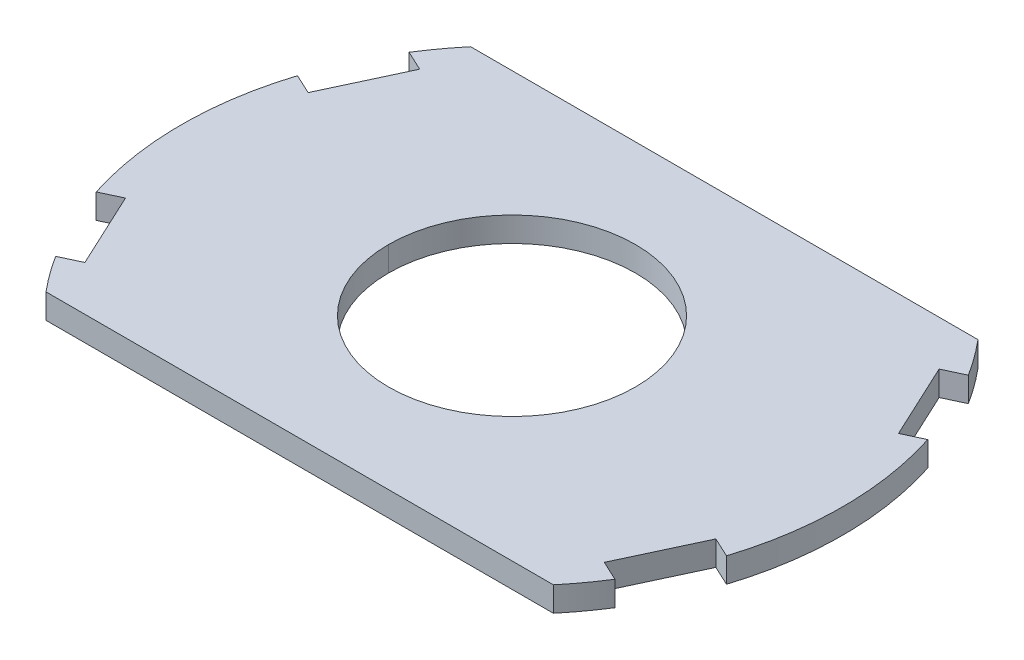
ISO-10303-21;
HEADER;
FILE_DESCRIPTION(('STEP AP214'),'2;1');
FILE_NAME('part.step','',(''),(''),'','','');
FILE_SCHEMA(('AUTOMOTIVE_DESIGN { 1 0 10303 214 1 1 1 1 }'));
ENDSEC;
DATA;
#1=APPLICATION_CONTEXT('core data for automotive mechanical design processes');
#2=APPLICATION_PROTOCOL_DEFINITION('international standard','automotive_design',2000,#1);
#3=PRODUCT_CONTEXT('',#1,'mechanical');
#4=PRODUCT('Part','Part','',(#3));
#5=PRODUCT_RELATED_PRODUCT_CATEGORY('part','',(#4));
#6=PRODUCT_DEFINITION_FORMATION('','',#4);
#7=PRODUCT_DEFINITION_CONTEXT('part definition',#1,'design');
#8=PRODUCT_DEFINITION('design','',#6,#7);
#9=PRODUCT_DEFINITION_SHAPE('','',#8);
#10=(LENGTH_UNIT() NAMED_UNIT(*) SI_UNIT(.MILLI.,.METRE.));
#11=(NAMED_UNIT(*) PLANE_ANGLE_UNIT() SI_UNIT($,.RADIAN.));
#12=(NAMED_UNIT(*) SI_UNIT($,.STERADIAN.) SOLID_ANGLE_UNIT());
#13=UNCERTAINTY_MEASURE_WITH_UNIT(LENGTH_MEASURE(1.E-05),#10,'distance_accuracy_value','');
#14=(GEOMETRIC_REPRESENTATION_CONTEXT(3) GLOBAL_UNCERTAINTY_ASSIGNED_CONTEXT((#13)) GLOBAL_UNIT_ASSIGNED_CONTEXT((#10,
#11,#12)) REPRESENTATION_CONTEXT('',''));
#15=CARTESIAN_POINT('',(0.,0.,0.));
#16=DIRECTION('',(0.,0.,1.));
#17=DIRECTION('',(1.,0.,0.));
#18=AXIS2_PLACEMENT_3D('',#15,#16,#17);
#19=CARTESIAN_POINT('',(0.,0.,0.));
#20=DIRECTION('',(0.,-1.,0.));
#21=DIRECTION('',(1.,0.,0.));
#22=AXIS2_PLACEMENT_3D('',#19,#20,#21);
#23=CYLINDRICAL_SURFACE('',#22,3.175);
#24=DIRECTION('',(0.,1.,0.));
#25=VECTOR('',#24,1.);
#26=CARTESIAN_POINT('',(3.175,0.,0.));
#27=LINE('',#26,#25);
#28=CARTESIAN_POINT('',(3.175,0.,0.));
#29=VERTEX_POINT('',#28);
#30=CARTESIAN_POINT('',(3.175,0.635,0.));
#31=VERTEX_POINT('',#30);
#32=EDGE_CURVE('E11',#29,#31,#27,.T.);
#33=ORIENTED_EDGE('',*,*,#32,.T.);
#34=CARTESIAN_POINT('',(0.,0.635,0.));
#35=DIRECTION('',(0.,-1.,0.));
#36=DIRECTION('',(-1.,0.,0.));
#37=AXIS2_PLACEMENT_3D('',#34,#35,#36);
#38=CIRCLE('',#37,3.175);
#39=CARTESIAN_POINT('',(-3.175,0.635,0.));
#40=VERTEX_POINT('',#39);
#41=EDGE_CURVE('E400',#40,#31,#38,.T.);
#42=ORIENTED_EDGE('',*,*,#41,.F.);
#43=DIRECTION('',(0.,1.,0.));
#44=VECTOR('',#43,1.);
#45=CARTESIAN_POINT('',(-3.175,0.,0.));
#46=LINE('',#45,#44);
#47=CARTESIAN_POINT('',(-3.175,0.,0.));
#48=VERTEX_POINT('',#47);
#49=EDGE_CURVE('E20',#48,#40,#46,.T.);
#50=ORIENTED_EDGE('',*,*,#49,.F.);
#51=CARTESIAN_POINT('',(0.,0.,0.));
#52=DIRECTION('',(0.,-1.,0.));
#53=DIRECTION('',(-1.,0.,0.));
#54=AXIS2_PLACEMENT_3D('',#51,#52,#53);
#55=CIRCLE('',#54,3.175);
#56=EDGE_CURVE('E306',#48,#29,#55,.T.);
#57=ORIENTED_EDGE('',*,*,#56,.T.);
#58=EDGE_LOOP('',(#33,#42,#50,#57));
#59=FACE_BOUND('',#58,.T.);
#60=ADVANCED_FACE('F17',(#59),#23,.F.);
#61=CARTESIAN_POINT('',(0.,0.,0.));
#62=DIRECTION('',(0.,-1.,0.));
#63=DIRECTION('',(1.,0.,0.));
#64=AXIS2_PLACEMENT_3D('',#61,#62,#63);
#65=CYLINDRICAL_SURFACE('',#64,3.175);
#66=ORIENTED_EDGE('',*,*,#49,.T.);
#67=CARTESIAN_POINT('',(0.,0.635,0.));
#68=DIRECTION('',(0.,-1.,0.));
#69=DIRECTION('',(1.,0.,0.));
#70=AXIS2_PLACEMENT_3D('',#67,#68,#69);
#71=CIRCLE('',#70,3.175);
#72=EDGE_CURVE('E404',#31,#40,#71,.T.);
#73=ORIENTED_EDGE('',*,*,#72,.F.);
#74=ORIENTED_EDGE('',*,*,#32,.F.);
#75=CARTESIAN_POINT('',(0.,0.,0.));
#76=DIRECTION('',(0.,-1.,0.));
#77=DIRECTION('',(1.,0.,0.));
#78=AXIS2_PLACEMENT_3D('',#75,#76,#77);
#79=CIRCLE('',#78,3.175);
#80=EDGE_CURVE('E309',#29,#48,#79,.T.);
#81=ORIENTED_EDGE('',*,*,#80,.T.);
#82=EDGE_LOOP('',(#66,#73,#74,#81));
#83=FACE_BOUND('',#82,.T.);
#84=ADVANCED_FACE('F608',(#83),#65,.F.);
#85=CARTESIAN_POINT('',(6.52537814996182,0.,-5.461));
#86=DIRECTION('',(0.,0.,-1.));
#87=DIRECTION('',(0.,-1.,0.));
#88=AXIS2_PLACEMENT_3D('',#85,#86,#87);
#89=PLANE('',#88);
#90=DIRECTION('',(0.,1.,0.));
#91=VECTOR('',#90,1.);
#92=CARTESIAN_POINT('',(-6.52537814996182,0.,-5.461));
#93=LINE('',#92,#91);
#94=CARTESIAN_POINT('',(-6.52537814996182,0.,-5.461));
#95=VERTEX_POINT('',#94);
#96=CARTESIAN_POINT('',(-6.52537814996182,0.635,-5.461));
#97=VERTEX_POINT('',#96);
#98=EDGE_CURVE('E321',#95,#97,#93,.T.);
#99=ORIENTED_EDGE('',*,*,#98,.T.);
#100=DIRECTION('',(-1.,0.,0.));
#101=VECTOR('',#100,1.);
#102=CARTESIAN_POINT('',(6.52537814996182,0.635,-5.461));
#103=LINE('',#102,#101);
#104=CARTESIAN_POINT('',(6.52537814996182,0.635,-5.461));
#105=VERTEX_POINT('',#104);
#106=EDGE_CURVE('E361',#105,#97,#103,.T.);
#107=ORIENTED_EDGE('',*,*,#106,.F.);
#108=DIRECTION('',(0.,1.,0.));
#109=VECTOR('',#108,1.);
#110=CARTESIAN_POINT('',(6.52537814996182,0.,-5.461));
#111=LINE('',#110,#109);
#112=CARTESIAN_POINT('',(6.52537814996182,0.,-5.461));
#113=VERTEX_POINT('',#112);
#114=EDGE_CURVE('E342',#113,#105,#111,.T.);
#115=ORIENTED_EDGE('',*,*,#114,.F.);
#116=DIRECTION('',(-1.,0.,0.));
#117=VECTOR('',#116,1.);
#118=CARTESIAN_POINT('',(6.52537814996182,0.,-5.461));
#119=LINE('',#118,#117);
#120=EDGE_CURVE('E284',#113,#95,#119,.T.);
#121=ORIENTED_EDGE('',*,*,#120,.T.);
#122=EDGE_LOOP('',(#99,#107,#115,#121));
#123=FACE_BOUND('',#122,.T.);
#124=ADVANCED_FACE('F600',(#123),#89,.T.);
#125=CARTESIAN_POINT('',(-7.19324470152094,0.,4.54536155482132));
#126=DIRECTION('',(0.422618261740681,0.,0.906307787036659));
#127=DIRECTION('',(0.,-1.,0.));
#128=AXIS2_PLACEMENT_3D('',#125,#126,#127);
#129=PLANE('',#128);
#130=DIRECTION('',(0.,1.,0.));
#131=VECTOR('',#130,1.);
#132=CARTESIAN_POINT('',(-7.19324470152094,0.,4.54536155482132));
#133=LINE('',#132,#131);
#134=CARTESIAN_POINT('',(-7.19324470152094,0.,4.54536155482132));
#135=VERTEX_POINT('',#134);
#136=CARTESIAN_POINT('',(-7.19324470152094,0.635,4.54536155482132));
#137=VERTEX_POINT('',#136);
#138=EDGE_CURVE('E233',#135,#137,#133,.T.);
#139=ORIENTED_EDGE('',*,*,#138,.T.);
#140=DIRECTION('',(0.906307787036641,0.,-0.422618261740719));
#141=VECTOR('',#140,1.);
#142=CARTESIAN_POINT('',(-7.19324470152094,0.635,4.54536155482132));
#143=LINE('',#142,#141);
#144=CARTESIAN_POINT('',(-6.68005110157796,0.635,4.30605544905298));
#145=VERTEX_POINT('',#144);
#146=EDGE_CURVE('E384',#137,#145,#143,.T.);
#147=ORIENTED_EDGE('',*,*,#146,.T.);
#148=DIRECTION('',(0.,1.,0.));
#149=VECTOR('',#148,1.);
#150=CARTESIAN_POINT('',(-6.68005110157796,0.,4.30605544905298));
#151=LINE('',#150,#149);
#152=CARTESIAN_POINT('',(-6.68005110157796,0.,4.30605544905298));
#153=VERTEX_POINT('',#152);
#154=EDGE_CURVE('E429',#153,#145,#151,.T.);
#155=ORIENTED_EDGE('',*,*,#154,.F.);
#156=DIRECTION('',(0.906307787036641,0.,-0.422618261740719));
#157=VECTOR('',#156,1.);
#158=CARTESIAN_POINT('',(-7.19324470152094,0.,4.54536155482132));
#159=LINE('',#158,#157);
#160=EDGE_CURVE('E238',#135,#153,#159,.T.);
#161=ORIENTED_EDGE('',*,*,#160,.F.);
#162=EDGE_LOOP('',(#139,#147,#155,#161));
#163=FACE_BOUND('',#162,.T.);
#164=ADVANCED_FACE('F593',(#163),#129,.F.);
#165=CARTESIAN_POINT('',(-6.68005110157796,0.,4.30605544905298));
#166=DIRECTION('',(0.906307787036641,0.,-0.422618261740719));
#167=DIRECTION('',(0.,-1.,0.));
#168=AXIS2_PLACEMENT_3D('',#165,#166,#167);
#169=PLANE('',#168);
#170=ORIENTED_EDGE('',*,*,#154,.T.);
#171=DIRECTION('',(-0.422618261740681,0.,-0.906307787036659));
#172=VECTOR('',#171,1.);
#173=CARTESIAN_POINT('',(-6.68005110157796,0.635,4.30605544905298));
#174=LINE('',#173,#172);
#175=CARTESIAN_POINT('',(-7.59248392867462,0.635,2.34933693684022));
#176=VERTEX_POINT('',#175);
#177=EDGE_CURVE('E376',#145,#176,#174,.T.);
#178=ORIENTED_EDGE('',*,*,#177,.T.);
#179=DIRECTION('',(0.,1.,0.));
#180=VECTOR('',#179,1.);
#181=CARTESIAN_POINT('',(-7.59248392867462,0.,2.34933693684022));
#182=LINE('',#181,#180);
#183=CARTESIAN_POINT('',(-7.59248392867462,0.,2.34933693684022));
#184=VERTEX_POINT('',#183);
#185=EDGE_CURVE('E427',#184,#176,#182,.T.);
#186=ORIENTED_EDGE('',*,*,#185,.F.);
#187=DIRECTION('',(-0.422618261740681,0.,-0.906307787036659));
#188=VECTOR('',#187,1.);
#189=CARTESIAN_POINT('',(-6.68005110157796,0.,4.30605544905298));
#190=LINE('',#189,#188);
#191=EDGE_CURVE('E254',#153,#184,#190,.T.);
#192=ORIENTED_EDGE('',*,*,#191,.F.);
#193=EDGE_LOOP('',(#170,#178,#186,#192));
#194=FACE_BOUND('',#193,.T.);
#195=ADVANCED_FACE('F585',(#194),#169,.F.);
#196=CARTESIAN_POINT('',(-7.59248392867462,0.,2.34933693684022));
#197=DIRECTION('',(-0.422618261740719,0.,-0.906307787036641));
#198=DIRECTION('',(-0.906307787036641,0.,0.422618261740719));
#199=AXIS2_PLACEMENT_3D('',#196,#197,#198);
#200=PLANE('',#199);
#201=ORIENTED_EDGE('',*,*,#185,.T.);
#202=DIRECTION('',(-0.906307787036641,0.,0.422618261740719));
#203=VECTOR('',#202,1.);
#204=CARTESIAN_POINT('',(-7.59248392867462,0.635,2.34933693684022));
#205=LINE('',#204,#203);
#206=CARTESIAN_POINT('',(-8.1056775286176,0.635,2.58864304260958));
#207=VERTEX_POINT('',#206);
#208=EDGE_CURVE('E372',#176,#207,#205,.T.);
#209=ORIENTED_EDGE('',*,*,#208,.T.);
#210=DIRECTION('',(0.,1.,0.));
#211=VECTOR('',#210,1.);
#212=CARTESIAN_POINT('',(-8.1056775286176,0.,2.58864304260958));
#213=LINE('',#212,#211);
#214=CARTESIAN_POINT('',(-8.1056775286176,0.,2.58864304260958));
#215=VERTEX_POINT('',#214);
#216=EDGE_CURVE('E227',#215,#207,#213,.T.);
#217=ORIENTED_EDGE('',*,*,#216,.F.);
#218=DIRECTION('',(-0.906307787036641,0.,0.422618261740719));
#219=VECTOR('',#218,1.);
#220=CARTESIAN_POINT('',(-7.59248392867462,0.,2.34933693684022));
#221=LINE('',#220,#219);
#222=EDGE_CURVE('E257',#184,#215,#221,.T.);
#223=ORIENTED_EDGE('',*,*,#222,.F.);
#224=EDGE_LOOP('',(#201,#209,#217,#223));
#225=FACE_BOUND('',#224,.T.);
#226=ADVANCED_FACE('F577',(#225),#200,.F.);
#227=CARTESIAN_POINT('',(-6.68005110157796,0.,-4.30605544905298));
#228=DIRECTION('',(0.422618261740681,0.,-0.906307787036659));
#229=DIRECTION('',(0.,-1.,0.));
#230=AXIS2_PLACEMENT_3D('',#227,#228,#229);
#231=PLANE('',#230);
#232=DIRECTION('',(0.,1.,0.));
#233=VECTOR('',#232,1.);
#234=CARTESIAN_POINT('',(-6.68005110157796,0.,-4.30605544905298));
#235=LINE('',#234,#233);
#236=CARTESIAN_POINT('',(-6.68005110157796,0.,-4.30605544905298));
#237=VERTEX_POINT('',#236);
#238=CARTESIAN_POINT('',(-6.68005110157796,0.635,-4.30605544905298));
#239=VERTEX_POINT('',#238);
#240=EDGE_CURVE('E424',#237,#239,#235,.T.);
#241=ORIENTED_EDGE('',*,*,#240,.T.);
#242=DIRECTION('',(-0.906307787036659,0.,-0.422618261740681));
#243=VECTOR('',#242,1.);
#244=CARTESIAN_POINT('',(-6.68005110157796,0.635,-4.30605544905298));
#245=LINE('',#244,#243);
#246=CARTESIAN_POINT('',(-7.19324470152094,0.635,-4.54536155482132));
#247=VERTEX_POINT('',#246);
#248=EDGE_CURVE('E325',#239,#247,#245,.T.);
#249=ORIENTED_EDGE('',*,*,#248,.T.);
#250=DIRECTION('',(0.,1.,0.));
#251=VECTOR('',#250,1.);
#252=CARTESIAN_POINT('',(-7.19324470152094,0.,-4.54536155482132));
#253=LINE('',#252,#251);
#254=CARTESIAN_POINT('',(-7.19324470152094,0.,-4.54536155482132));
#255=VERTEX_POINT('',#254);
#256=EDGE_CURVE('E416',#255,#247,#253,.T.);
#257=ORIENTED_EDGE('',*,*,#256,.F.);
#258=DIRECTION('',(-0.906307787036659,0.,-0.422618261740681));
#259=VECTOR('',#258,1.);
#260=CARTESIAN_POINT('',(-6.68005110157796,0.,-4.30605544905298));
#261=LINE('',#260,#259);
#262=EDGE_CURVE('E273',#237,#255,#261,.T.);
#263=ORIENTED_EDGE('',*,*,#262,.F.);
#264=EDGE_LOOP('',(#241,#249,#257,#263));
#265=FACE_BOUND('',#264,.T.);
#266=ADVANCED_FACE('F569',(#265),#231,.F.);
#267=CARTESIAN_POINT('',(-7.59248392867462,0.,-2.34933693684022));
#268=DIRECTION('',(0.906307787036641,0.,0.422618261740719));
#269=DIRECTION('',(0.,-1.,0.));
#270=AXIS2_PLACEMENT_3D('',#267,#268,#269);
#271=PLANE('',#270);
#272=DIRECTION('',(0.,1.,0.));
#273=VECTOR('',#272,1.);
#274=CARTESIAN_POINT('',(-7.59248392867462,0.,-2.34933693684022));
#275=LINE('',#274,#273);
#276=CARTESIAN_POINT('',(-7.59248392867462,0.,-2.34933693684022));
#277=VERTEX_POINT('',#276);
#278=CARTESIAN_POINT('',(-7.59248392867462,0.635,-2.34933693684022));
#279=VERTEX_POINT('',#278);
#280=EDGE_CURVE('E421',#277,#279,#275,.T.);
#281=ORIENTED_EDGE('',*,*,#280,.T.);
#282=DIRECTION('',(0.422618261740681,0.,-0.906307787036659));
#283=VECTOR('',#282,1.);
#284=CARTESIAN_POINT('',(-7.59248392867462,0.635,-2.34933693684022));
#285=LINE('',#284,#283);
#286=EDGE_CURVE('E329',#279,#239,#285,.T.);
#287=ORIENTED_EDGE('',*,*,#286,.T.);
#288=ORIENTED_EDGE('',*,*,#240,.F.);
#289=DIRECTION('',(0.422618261740681,0.,-0.906307787036659));
#290=VECTOR('',#289,1.);
#291=CARTESIAN_POINT('',(-7.59248392867462,0.,-2.34933693684022));
#292=LINE('',#291,#290);
#293=EDGE_CURVE('E271',#277,#237,#292,.T.);
#294=ORIENTED_EDGE('',*,*,#293,.F.);
#295=EDGE_LOOP('',(#281,#287,#288,#294));
#296=FACE_BOUND('',#295,.T.);
#297=ADVANCED_FACE('F445',(#296),#271,.F.);
#298=CARTESIAN_POINT('',(-8.1056775286176,0.,-2.58864304260958));
#299=DIRECTION('',(-0.422618261740719,0.,0.906307787036641));
#300=DIRECTION('',(0.,1.,0.));
#301=AXIS2_PLACEMENT_3D('',#298,#299,#300);
#302=PLANE('',#301);
#303=DIRECTION('',(0.,1.,0.));
#304=VECTOR('',#303,1.);
#305=CARTESIAN_POINT('',(-8.1056775286176,0.,-2.58864304260958));
#306=LINE('',#305,#304);
#307=CARTESIAN_POINT('',(-8.1056775286176,0.,-2.58864304260958));
#308=VERTEX_POINT('',#307);
#309=CARTESIAN_POINT('',(-8.1056775286176,0.635,-2.58864304260958));
#310=VERTEX_POINT('',#309);
#311=EDGE_CURVE('E318',#308,#310,#306,.T.);
#312=ORIENTED_EDGE('',*,*,#311,.T.);
#313=DIRECTION('',(0.906307787036641,0.,0.422618261740719));
#314=VECTOR('',#313,1.);
#315=CARTESIAN_POINT('',(-8.1056775286176,0.635,-2.58864304260958));
#316=LINE('',#315,#314);
#317=EDGE_CURVE('E371',#310,#279,#316,.T.);
#318=ORIENTED_EDGE('',*,*,#317,.T.);
#319=ORIENTED_EDGE('',*,*,#280,.F.);
#320=DIRECTION('',(0.906307787036641,0.,0.422618261740719));
#321=VECTOR('',#320,1.);
#322=CARTESIAN_POINT('',(-8.1056775286176,0.,-2.58864304260958));
#323=LINE('',#322,#321);
#324=EDGE_CURVE('E268',#308,#277,#323,.T.);
#325=ORIENTED_EDGE('',*,*,#324,.F.);
#326=EDGE_LOOP('',(#312,#318,#319,#325));
#327=FACE_BOUND('',#326,.T.);
#328=ADVANCED_FACE('F440',(#327),#302,.F.);
#329=CARTESIAN_POINT('',(0.,0.,0.));
#330=DIRECTION('',(0.,1.,0.));
#331=DIRECTION('',(1.,0.,0.));
#332=AXIS2_PLACEMENT_3D('',#329,#330,#331);
#333=CYLINDRICAL_SURFACE('',#332,8.509);
#334=CARTESIAN_POINT('',(0.,0.,0.));
#335=DIRECTION('',(0.,1.,0.));
#336=DIRECTION('',(-0.845368985958431,0.,0.534182812883019));
#337=AXIS2_PLACEMENT_3D('',#334,#335,#336);
#338=CIRCLE('',#337,8.509);
#339=CARTESIAN_POINT('',(-6.52537814996182,0.,5.461));
#340=VERTEX_POINT('',#339);
#341=EDGE_CURVE('E231',#135,#340,#338,.T.);
#342=ORIENTED_EDGE('',*,*,#341,.T.);
#343=DIRECTION('',(0.,1.,0.));
#344=VECTOR('',#343,1.);
#345=CARTESIAN_POINT('',(-6.52537814996182,0.,5.461));
#346=LINE('',#345,#344);
#347=CARTESIAN_POINT('',(-6.52537814996182,0.635,5.461));
#348=VERTEX_POINT('',#347);
#349=EDGE_CURVE('E215',#340,#348,#346,.T.);
#350=ORIENTED_EDGE('',*,*,#349,.T.);
#351=CARTESIAN_POINT('',(0.,0.635,0.));
#352=DIRECTION('',(0.,1.,0.));
#353=DIRECTION('',(-0.845368985958431,0.,0.534182812883019));
#354=AXIS2_PLACEMENT_3D('',#351,#352,#353);
#355=CIRCLE('',#354,8.509);
#356=EDGE_CURVE('E288',#137,#348,#355,.T.);
#357=ORIENTED_EDGE('',*,*,#356,.F.);
#358=ORIENTED_EDGE('',*,*,#138,.F.);
#359=EDGE_LOOP('',(#342,#350,#357,#358));
#360=FACE_BOUND('',#359,.T.);
#361=ADVANCED_FACE('F232',(#360),#333,.T.);
#362=CARTESIAN_POINT('',(0.,0.,0.));
#363=DIRECTION('',(0.,1.,0.));
#364=DIRECTION('',(1.,0.,0.));
#365=AXIS2_PLACEMENT_3D('',#362,#363,#364);
#366=CYLINDRICAL_SURFACE('',#365,8.509);
#367=CARTESIAN_POINT('',(0.,0.635,0.));
#368=DIRECTION('',(0.,1.,0.));
#369=DIRECTION('',(-0.766879556935228,0.,-0.641791044776124));
#370=AXIS2_PLACEMENT_3D('',#367,#368,#369);
#371=CIRCLE('',#370,8.509);
#372=EDGE_CURVE('E330',#97,#247,#371,.T.);
#373=ORIENTED_EDGE('',*,*,#372,.F.);
#374=ORIENTED_EDGE('',*,*,#98,.F.);
#375=CARTESIAN_POINT('',(0.,0.,0.));
#376=DIRECTION('',(0.,1.,0.));
#377=DIRECTION('',(-0.766879556935228,0.,-0.641791044776124));
#378=AXIS2_PLACEMENT_3D('',#375,#376,#377);
#379=CIRCLE('',#378,8.509);
#380=EDGE_CURVE('E277',#95,#255,#379,.T.);
#381=ORIENTED_EDGE('',*,*,#380,.T.);
#382=ORIENTED_EDGE('',*,*,#256,.T.);
#383=EDGE_LOOP('',(#373,#374,#381,#382));
#384=FACE_BOUND('',#383,.T.);
#385=ADVANCED_FACE('F459',(#384),#366,.T.);
#386=CARTESIAN_POINT('',(0.,0.,0.));
#387=DIRECTION('',(0.,1.,0.));
#388=DIRECTION('',(1.,0.,0.));
#389=AXIS2_PLACEMENT_3D('',#386,#387,#388);
#390=CYLINDRICAL_SURFACE('',#389,8.509);
#391=CARTESIAN_POINT('',(0.,0.,0.));
#392=DIRECTION('',(0.,1.,0.));
#393=DIRECTION('',(-0.952600485206051,0.,-0.304224120649884));
#394=AXIS2_PLACEMENT_3D('',#391,#392,#393);
#395=CIRCLE('',#394,8.509);
#396=EDGE_CURVE('E264',#308,#215,#395,.T.);
#397=ORIENTED_EDGE('',*,*,#396,.T.);
#398=ORIENTED_EDGE('',*,*,#216,.T.);
#399=CARTESIAN_POINT('',(0.,0.635,0.));
#400=DIRECTION('',(0.,1.,0.));
#401=DIRECTION('',(-0.952600485206051,0.,-0.304224120649884));
#402=AXIS2_PLACEMENT_3D('',#399,#400,#401);
#403=CIRCLE('',#402,8.509);
#404=EDGE_CURVE('E377',#310,#207,#403,.T.);
#405=ORIENTED_EDGE('',*,*,#404,.F.);
#406=ORIENTED_EDGE('',*,*,#311,.F.);
#407=EDGE_LOOP('',(#397,#398,#405,#406));
#408=FACE_BOUND('',#407,.T.);
#409=ADVANCED_FACE('F463',(#408),#390,.T.);
#410=CARTESIAN_POINT('',(-6.52537814996182,0.,5.461));
#411=DIRECTION('',(0.,0.,1.));
#412=DIRECTION('',(1.,0.,0.));
#413=AXIS2_PLACEMENT_3D('',#410,#411,#412);
#414=PLANE('',#413);
#415=DIRECTION('',(0.,1.,0.));
#416=VECTOR('',#415,1.);
#417=CARTESIAN_POINT('',(6.52537814996182,0.,5.461));
#418=LINE('',#417,#416);
#419=CARTESIAN_POINT('',(6.52537814996182,0.,5.461));
#420=VERTEX_POINT('',#419);
#421=CARTESIAN_POINT('',(6.52537814996182,0.635,5.461));
#422=VERTEX_POINT('',#421);
#423=EDGE_CURVE('E310',#420,#422,#418,.T.);
#424=ORIENTED_EDGE('',*,*,#423,.T.);
#425=DIRECTION('',(1.,0.,0.));
#426=VECTOR('',#425,1.);
#427=CARTESIAN_POINT('',(-6.52537814996182,0.635,5.461));
#428=LINE('',#427,#426);
#429=EDGE_CURVE('E222',#348,#422,#428,.T.);
#430=ORIENTED_EDGE('',*,*,#429,.F.);
#431=ORIENTED_EDGE('',*,*,#349,.F.);
#432=DIRECTION('',(1.,0.,0.));
#433=VECTOR('',#432,1.);
#434=CARTESIAN_POINT('',(-6.52537814996182,0.,5.461));
#435=LINE('',#434,#433);
#436=EDGE_CURVE('E220',#340,#420,#435,.T.);
#437=ORIENTED_EDGE('',*,*,#436,.T.);
#438=EDGE_LOOP('',(#424,#430,#431,#437));
#439=FACE_BOUND('',#438,.T.);
#440=ADVANCED_FACE('F218',(#439),#414,.T.);
#441=CARTESIAN_POINT('',(6.68005110157796,0.,4.30605544905298));
#442=DIRECTION('',(-0.422618261740681,0.,0.906307787036659));
#443=DIRECTION('',(0.,1.,0.));
#444=AXIS2_PLACEMENT_3D('',#441,#442,#443);
#445=PLANE('',#444);
#446=DIRECTION('',(0.,1.,0.));
#447=VECTOR('',#446,1.);
#448=CARTESIAN_POINT('',(6.68005110157796,0.,4.30605544905298));
#449=LINE('',#448,#447);
#450=CARTESIAN_POINT('',(6.68005110157796,0.,4.30605544905298));
#451=VERTEX_POINT('',#450);
#452=CARTESIAN_POINT('',(6.68005110157796,0.635,4.30605544905298));
#453=VERTEX_POINT('',#452);
#454=EDGE_CURVE('E228',#451,#453,#449,.T.);
#455=ORIENTED_EDGE('',*,*,#454,.T.);
#456=DIRECTION('',(0.906307787036659,0.,0.422618261740681));
#457=VECTOR('',#456,1.);
#458=CARTESIAN_POINT('',(6.68005110157796,0.635,4.30605544905298));
#459=LINE('',#458,#457);
#460=CARTESIAN_POINT('',(7.19324470152094,0.635,4.54536155482132));
#461=VERTEX_POINT('',#460);
#462=EDGE_CURVE('E287',#453,#461,#459,.T.);
#463=ORIENTED_EDGE('',*,*,#462,.T.);
#464=DIRECTION('',(0.,1.,0.));
#465=VECTOR('',#464,1.);
#466=CARTESIAN_POINT('',(7.19324470152094,0.,4.54536155482132));
#467=LINE('',#466,#465);
#468=CARTESIAN_POINT('',(7.19324470152094,0.,4.54536155482132));
#469=VERTEX_POINT('',#468);
#470=EDGE_CURVE('E313',#469,#461,#467,.T.);
#471=ORIENTED_EDGE('',*,*,#470,.F.);
#472=DIRECTION('',(0.906307787036659,0.,0.422618261740681));
#473=VECTOR('',#472,1.);
#474=CARTESIAN_POINT('',(6.68005110157796,0.,4.30605544905298));
#475=LINE('',#474,#473);
#476=EDGE_CURVE('E250',#451,#469,#475,.T.);
#477=ORIENTED_EDGE('',*,*,#476,.F.);
#478=EDGE_LOOP('',(#455,#463,#471,#477));
#479=FACE_BOUND('',#478,.T.);
#480=ADVANCED_FACE('F497',(#479),#445,.F.);
#481=CARTESIAN_POINT('',(7.59248392867462,0.,2.34933693684022));
#482=DIRECTION('',(-0.906307787036641,0.,-0.422618261740719));
#483=DIRECTION('',(-0.422618261740719,0.,0.906307787036641));
#484=AXIS2_PLACEMENT_3D('',#481,#482,#483);
#485=PLANE('',#484);
#486=DIRECTION('',(0.,1.,0.));
#487=VECTOR('',#486,1.);
#488=CARTESIAN_POINT('',(7.59248392867462,0.,2.34933693684022));
#489=LINE('',#488,#487);
#490=CARTESIAN_POINT('',(7.59248392867462,0.,2.34933693684022));
#491=VERTEX_POINT('',#490);
#492=CARTESIAN_POINT('',(7.59248392867462,0.635,2.34933693684022));
#493=VERTEX_POINT('',#492);
#494=EDGE_CURVE('E407',#491,#493,#489,.T.);
#495=ORIENTED_EDGE('',*,*,#494,.T.);
#496=DIRECTION('',(-0.422618261740681,0.,0.906307787036659));
#497=VECTOR('',#496,1.);
#498=CARTESIAN_POINT('',(7.59248392867462,0.635,2.34933693684022));
#499=LINE('',#498,#497);
#500=EDGE_CURVE('E392',#493,#453,#499,.T.);
#501=ORIENTED_EDGE('',*,*,#500,.T.);
#502=ORIENTED_EDGE('',*,*,#454,.F.);
#503=DIRECTION('',(-0.422618261740681,0.,0.906307787036659));
#504=VECTOR('',#503,1.);
#505=CARTESIAN_POINT('',(7.59248392867462,0.,2.34933693684022));
#506=LINE('',#505,#504);
#507=EDGE_CURVE('E711',#491,#451,#506,.T.);
#508=ORIENTED_EDGE('',*,*,#507,.F.);
#509=EDGE_LOOP('',(#495,#501,#502,#508));
#510=FACE_BOUND('',#509,.T.);
#511=ADVANCED_FACE('F492',(#510),#485,.F.);
#512=CARTESIAN_POINT('',(8.1056775286176,0.,2.58864304260958));
#513=DIRECTION('',(0.422618261740719,0.,-0.906307787036641));
#514=DIRECTION('',(0.,-1.,0.));
#515=AXIS2_PLACEMENT_3D('',#512,#513,#514);
#516=PLANE('',#515);
#517=DIRECTION('',(0.,1.,0.));
#518=VECTOR('',#517,1.);
#519=CARTESIAN_POINT('',(8.1056775286176,0.,2.58864304260958));
#520=LINE('',#519,#518);
#521=CARTESIAN_POINT('',(8.1056775286176,0.,2.58864304260958));
#522=VERTEX_POINT('',#521);
#523=CARTESIAN_POINT('',(8.1056775286176,0.635,2.58864304260958));
#524=VERTEX_POINT('',#523);
#525=EDGE_CURVE('E354',#522,#524,#520,.T.);
#526=ORIENTED_EDGE('',*,*,#525,.T.);
#527=DIRECTION('',(-0.906307787036641,0.,-0.422618261740719));
#528=VECTOR('',#527,1.);
#529=CARTESIAN_POINT('',(8.1056775286176,0.635,2.58864304260958));
#530=LINE('',#529,#528);
#531=EDGE_CURVE('E395',#524,#493,#530,.T.);
#532=ORIENTED_EDGE('',*,*,#531,.T.);
#533=ORIENTED_EDGE('',*,*,#494,.F.);
#534=DIRECTION('',(-0.906307787036641,0.,-0.422618261740719));
#535=VECTOR('',#534,1.);
#536=CARTESIAN_POINT('',(8.1056775286176,0.,2.58864304260958));
#537=LINE('',#536,#535);
#538=EDGE_CURVE('E705',#522,#491,#537,.T.);
#539=ORIENTED_EDGE('',*,*,#538,.F.);
#540=EDGE_LOOP('',(#526,#532,#533,#539));
#541=FACE_BOUND('',#540,.T.);
#542=ADVANCED_FACE('F496',(#541),#516,.F.);
#543=CARTESIAN_POINT('',(0.,0.635,0.));
#544=DIRECTION('',(0.,1.,0.));
#545=DIRECTION('',(1.,0.,0.));
#546=AXIS2_PLACEMENT_3D('',#543,#544,#545);
#547=PLANE('',#546);
#548=ORIENTED_EDGE('',*,*,#41,.T.);
#549=ORIENTED_EDGE('',*,*,#72,.T.);
#550=EDGE_LOOP('',(#548,#549));
#551=FACE_BOUND('',#550,.T.);
#552=CARTESIAN_POINT('',(0.,0.635,0.));
#553=DIRECTION('',(0.,1.,0.));
#554=DIRECTION('',(0.845368985958431,0.,-0.534182812883019));
#555=AXIS2_PLACEMENT_3D('',#552,#553,#554);
#556=CIRCLE('',#555,8.509);
#557=CARTESIAN_POINT('',(7.19324470152094,0.635,-4.54536155482132));
#558=VERTEX_POINT('',#557);
#559=EDGE_CURVE('E337',#558,#105,#556,.T.);
#560=ORIENTED_EDGE('',*,*,#559,.T.);
#561=ORIENTED_EDGE('',*,*,#106,.T.);
#562=ORIENTED_EDGE('',*,*,#372,.T.);
#563=ORIENTED_EDGE('',*,*,#248,.F.);
#564=ORIENTED_EDGE('',*,*,#286,.F.);
#565=ORIENTED_EDGE('',*,*,#317,.F.);
#566=ORIENTED_EDGE('',*,*,#404,.T.);
#567=ORIENTED_EDGE('',*,*,#208,.F.);
#568=ORIENTED_EDGE('',*,*,#177,.F.);
#569=ORIENTED_EDGE('',*,*,#146,.F.);
#570=ORIENTED_EDGE('',*,*,#356,.T.);
#571=ORIENTED_EDGE('',*,*,#429,.T.);
#572=CARTESIAN_POINT('',(0.,0.635,0.));
#573=DIRECTION('',(0.,1.,0.));
#574=DIRECTION('',(0.766879556935228,0.,0.641791044776124));
#575=AXIS2_PLACEMENT_3D('',#572,#573,#574);
#576=CIRCLE('',#575,8.509);
#577=EDGE_CURVE('E314',#422,#461,#576,.T.);
#578=ORIENTED_EDGE('',*,*,#577,.T.);
#579=ORIENTED_EDGE('',*,*,#462,.F.);
#580=ORIENTED_EDGE('',*,*,#500,.F.);
#581=ORIENTED_EDGE('',*,*,#531,.F.);
#582=CARTESIAN_POINT('',(0.,0.635,0.));
#583=DIRECTION('',(0.,1.,0.));
#584=DIRECTION('',(0.952600485206051,0.,0.304224120649884));
#585=AXIS2_PLACEMENT_3D('',#582,#583,#584);
#586=CIRCLE('',#585,8.509);
#587=CARTESIAN_POINT('',(8.1056775286176,0.635,-2.58864304260958));
#588=VERTEX_POINT('',#587);
#589=EDGE_CURVE('E341',#524,#588,#586,.T.);
#590=ORIENTED_EDGE('',*,*,#589,.T.);
#591=DIRECTION('',(0.906307787036641,0.,-0.422618261740719));
#592=VECTOR('',#591,1.);
#593=CARTESIAN_POINT('',(7.59248392867462,0.635,-2.34933693684022));
#594=LINE('',#593,#592);
#595=CARTESIAN_POINT('',(7.59248392867462,0.635,-2.34933693684022));
#596=VERTEX_POINT('',#595);
#597=EDGE_CURVE('E258',#596,#588,#594,.T.);
#598=ORIENTED_EDGE('',*,*,#597,.F.);
#599=DIRECTION('',(0.422618261740681,0.,0.906307787036659));
#600=VECTOR('',#599,1.);
#601=CARTESIAN_POINT('',(6.68005110157796,0.635,-4.30605544905298));
#602=LINE('',#601,#600);
#603=CARTESIAN_POINT('',(6.68005110157796,0.635,-4.30605544905298));
#604=VERTEX_POINT('',#603);
#605=EDGE_CURVE('E301',#604,#596,#602,.T.);
#606=ORIENTED_EDGE('',*,*,#605,.F.);
#607=DIRECTION('',(-0.906307787036641,0.,0.422618261740719));
#608=VECTOR('',#607,1.);
#609=CARTESIAN_POINT('',(7.19324470152094,0.635,-4.54536155482132));
#610=LINE('',#609,#608);
#611=EDGE_CURVE('E302',#558,#604,#610,.T.);
#612=ORIENTED_EDGE('',*,*,#611,.F.);
#613=EDGE_LOOP('',(#560,#561,#562,#563,#564,#565,#566,#567,#568,#569,#570,#571,#578,#579,#580,
#581,#590,#598,#606,#612));
#614=FACE_BOUND('',#613,.T.);
#615=ADVANCED_FACE('F528',(#551,#614),#547,.T.);
#616=CARTESIAN_POINT('',(0.,0.,0.));
#617=DIRECTION('',(0.,1.,0.));
#618=DIRECTION('',(1.,0.,0.));
#619=AXIS2_PLACEMENT_3D('',#616,#617,#618);
#620=CYLINDRICAL_SURFACE('',#619,8.509);
#621=ORIENTED_EDGE('',*,*,#577,.F.);
#622=ORIENTED_EDGE('',*,*,#423,.F.);
#623=CARTESIAN_POINT('',(0.,0.,0.));
#624=DIRECTION('',(0.,1.,0.));
#625=DIRECTION('',(0.766879556935228,0.,0.641791044776124));
#626=AXIS2_PLACEMENT_3D('',#623,#624,#625);
#627=CIRCLE('',#626,8.509);
#628=EDGE_CURVE('E244',#420,#469,#627,.T.);
#629=ORIENTED_EDGE('',*,*,#628,.T.);
#630=ORIENTED_EDGE('',*,*,#470,.T.);
#631=EDGE_LOOP('',(#621,#622,#629,#630));
#632=FACE_BOUND('',#631,.T.);
#633=ADVANCED_FACE('F520',(#632),#620,.T.);
#634=CARTESIAN_POINT('',(0.,0.,0.));
#635=DIRECTION('',(0.,1.,0.));
#636=DIRECTION('',(1.,0.,0.));
#637=AXIS2_PLACEMENT_3D('',#634,#635,#636);
#638=CYLINDRICAL_SURFACE('',#637,8.509);
#639=ORIENTED_EDGE('',*,*,#589,.F.);
#640=ORIENTED_EDGE('',*,*,#525,.F.);
#641=CARTESIAN_POINT('',(0.,0.,0.));
#642=DIRECTION('',(0.,1.,0.));
#643=DIRECTION('',(0.952600485206051,0.,0.304224120649884));
#644=AXIS2_PLACEMENT_3D('',#641,#642,#643);
#645=CIRCLE('',#644,8.509);
#646=CARTESIAN_POINT('',(8.1056775286176,0.,-2.58864304260958));
#647=VERTEX_POINT('',#646);
#648=EDGE_CURVE('E702',#522,#647,#645,.T.);
#649=ORIENTED_EDGE('',*,*,#648,.T.);
#650=DIRECTION('',(0.,1.,0.));
#651=VECTOR('',#650,1.);
#652=CARTESIAN_POINT('',(8.1056775286176,0.,-2.58864304260958));
#653=LINE('',#652,#651);
#654=EDGE_CURVE('E262',#647,#588,#653,.T.);
#655=ORIENTED_EDGE('',*,*,#654,.T.);
#656=EDGE_LOOP('',(#639,#640,#649,#655));
#657=FACE_BOUND('',#656,.T.);
#658=ADVANCED_FACE('F512',(#657),#638,.T.);
#659=CARTESIAN_POINT('',(0.,0.,0.));
#660=DIRECTION('',(0.,1.,0.));
#661=DIRECTION('',(1.,0.,0.));
#662=AXIS2_PLACEMENT_3D('',#659,#660,#661);
#663=CYLINDRICAL_SURFACE('',#662,8.509);
#664=CARTESIAN_POINT('',(0.,0.,0.));
#665=DIRECTION('',(0.,1.,0.));
#666=DIRECTION('',(0.845368985958431,0.,-0.534182812883019));
#667=AXIS2_PLACEMENT_3D('',#664,#665,#666);
#668=CIRCLE('',#667,8.509);
#669=CARTESIAN_POINT('',(7.19324470152094,0.,-4.54536155482132));
#670=VERTEX_POINT('',#669);
#671=EDGE_CURVE('E292',#670,#113,#668,.T.);
#672=ORIENTED_EDGE('',*,*,#671,.T.);
#673=ORIENTED_EDGE('',*,*,#114,.T.);
#674=ORIENTED_EDGE('',*,*,#559,.F.);
#675=DIRECTION('',(0.,1.,0.));
#676=VECTOR('',#675,1.);
#677=CARTESIAN_POINT('',(7.19324470152094,0.,-4.54536155482132));
#678=LINE('',#677,#676);
#679=EDGE_CURVE('E317',#670,#558,#678,.T.);
#680=ORIENTED_EDGE('',*,*,#679,.F.);
#681=EDGE_LOOP('',(#672,#673,#674,#680));
#682=FACE_BOUND('',#681,.T.);
#683=ADVANCED_FACE('F487',(#682),#663,.T.);
#684=CARTESIAN_POINT('',(7.59248392867462,0.,-2.34933693684022));
#685=DIRECTION('',(0.422618261740719,0.,0.906307787036641));
#686=DIRECTION('',(0.,-1.,0.));
#687=AXIS2_PLACEMENT_3D('',#684,#685,#686);
#688=PLANE('',#687);
#689=DIRECTION('',(0.,1.,0.));
#690=VECTOR('',#689,1.);
#691=CARTESIAN_POINT('',(7.59248392867462,0.,-2.34933693684022));
#692=LINE('',#691,#690);
#693=CARTESIAN_POINT('',(7.59248392867462,0.,-2.34933693684022));
#694=VERTEX_POINT('',#693);
#695=EDGE_CURVE('E263',#694,#596,#692,.T.);
#696=ORIENTED_EDGE('',*,*,#695,.T.);
#697=ORIENTED_EDGE('',*,*,#597,.T.);
#698=ORIENTED_EDGE('',*,*,#654,.F.);
#699=DIRECTION('',(0.906307787036641,0.,-0.422618261740719));
#700=VECTOR('',#699,1.);
#701=CARTESIAN_POINT('',(7.59248392867462,0.,-2.34933693684022));
#702=LINE('',#701,#700);
#703=EDGE_CURVE('E700',#694,#647,#702,.T.);
#704=ORIENTED_EDGE('',*,*,#703,.F.);
#705=EDGE_LOOP('',(#696,#697,#698,#704));
#706=FACE_BOUND('',#705,.T.);
#707=ADVANCED_FACE('F479',(#706),#688,.F.);
#708=CARTESIAN_POINT('',(6.68005110157796,0.,-4.30605544905298));
#709=DIRECTION('',(-0.906307787036641,0.,0.422618261740719));
#710=DIRECTION('',(0.,1.,0.));
#711=AXIS2_PLACEMENT_3D('',#708,#709,#710);
#712=PLANE('',#711);
#713=DIRECTION('',(0.,1.,0.));
#714=VECTOR('',#713,1.);
#715=CARTESIAN_POINT('',(6.68005110157796,0.,-4.30605544905298));
#716=LINE('',#715,#714);
#717=CARTESIAN_POINT('',(6.68005110157796,0.,-4.30605544905298));
#718=VERTEX_POINT('',#717);
#719=EDGE_CURVE('E297',#718,#604,#716,.T.);
#720=ORIENTED_EDGE('',*,*,#719,.T.);
#721=ORIENTED_EDGE('',*,*,#605,.T.);
#722=ORIENTED_EDGE('',*,*,#695,.F.);
#723=DIRECTION('',(0.422618261740681,0.,0.906307787036659));
#724=VECTOR('',#723,1.);
#725=CARTESIAN_POINT('',(6.68005110157796,0.,-4.30605544905298));
#726=LINE('',#725,#724);
#727=EDGE_CURVE('E731',#718,#694,#726,.T.);
#728=ORIENTED_EDGE('',*,*,#727,.F.);
#729=EDGE_LOOP('',(#720,#721,#722,#728));
#730=FACE_BOUND('',#729,.T.);
#731=ADVANCED_FACE('F471',(#730),#712,.F.);
#732=CARTESIAN_POINT('',(7.19324470152094,0.,-4.54536155482132));
#733=DIRECTION('',(-0.422618261740681,0.,-0.906307787036659));
#734=DIRECTION('',(-0.906307787036659,0.,0.422618261740681));
#735=AXIS2_PLACEMENT_3D('',#732,#733,#734);
#736=PLANE('',#735);
#737=ORIENTED_EDGE('',*,*,#679,.T.);
#738=ORIENTED_EDGE('',*,*,#611,.T.);
#739=ORIENTED_EDGE('',*,*,#719,.F.);
#740=DIRECTION('',(-0.906307787036641,0.,0.422618261740719));
#741=VECTOR('',#740,1.);
#742=CARTESIAN_POINT('',(7.19324470152094,0.,-4.54536155482132));
#743=LINE('',#742,#741);
#744=EDGE_CURVE('E296',#670,#718,#743,.T.);
#745=ORIENTED_EDGE('',*,*,#744,.F.);
#746=EDGE_LOOP('',(#737,#738,#739,#745));
#747=FACE_BOUND('',#746,.T.);
#748=ADVANCED_FACE('F454',(#747),#736,.F.);
#749=CARTESIAN_POINT('',(0.,0.,0.));
#750=DIRECTION('',(0.,1.,0.));
#751=DIRECTION('',(1.,0.,0.));
#752=AXIS2_PLACEMENT_3D('',#749,#750,#751);
#753=PLANE('',#752);
#754=ORIENTED_EDGE('',*,*,#56,.F.);
#755=ORIENTED_EDGE('',*,*,#80,.F.);
#756=EDGE_LOOP('',(#754,#755));
#757=FACE_BOUND('',#756,.T.);
#758=ORIENTED_EDGE('',*,*,#727,.T.);
#759=ORIENTED_EDGE('',*,*,#703,.T.);
#760=ORIENTED_EDGE('',*,*,#648,.F.);
#761=ORIENTED_EDGE('',*,*,#538,.T.);
#762=ORIENTED_EDGE('',*,*,#507,.T.);
#763=ORIENTED_EDGE('',*,*,#476,.T.);
#764=ORIENTED_EDGE('',*,*,#628,.F.);
#765=ORIENTED_EDGE('',*,*,#436,.F.);
#766=ORIENTED_EDGE('',*,*,#341,.F.);
#767=ORIENTED_EDGE('',*,*,#160,.T.);
#768=ORIENTED_EDGE('',*,*,#191,.T.);
#769=ORIENTED_EDGE('',*,*,#222,.T.);
#770=ORIENTED_EDGE('',*,*,#396,.F.);
#771=ORIENTED_EDGE('',*,*,#324,.T.);
#772=ORIENTED_EDGE('',*,*,#293,.T.);
#773=ORIENTED_EDGE('',*,*,#262,.T.);
#774=ORIENTED_EDGE('',*,*,#380,.F.);
#775=ORIENTED_EDGE('',*,*,#120,.F.);
#776=ORIENTED_EDGE('',*,*,#671,.F.);
#777=ORIENTED_EDGE('',*,*,#744,.T.);
#778=EDGE_LOOP('',(#758,#759,#760,#761,#762,#763,#764,#765,#766,#767,#768,#769,#770,#771,#772,
#773,#774,#775,#776,#777));
#779=FACE_BOUND('',#778,.T.);
#780=ADVANCED_FACE('F241',(#757,#779),#753,.F.);
#781=CLOSED_SHELL('',(#60,#84,#124,#164,#195,#226,#266,#297,#328,#361,#385,#409,#440,#480,#511,
#542,#615,#633,#658,#683,#707,#731,#748,#780));
#782=MANIFOLD_SOLID_BREP('B1',#781);
#783=ADVANCED_BREP_SHAPE_REPRESENTATION('',(#18,#782),#14);
#784=SHAPE_DEFINITION_REPRESENTATION(#9,#783);
ENDSEC;
END-ISO-10303-21;
